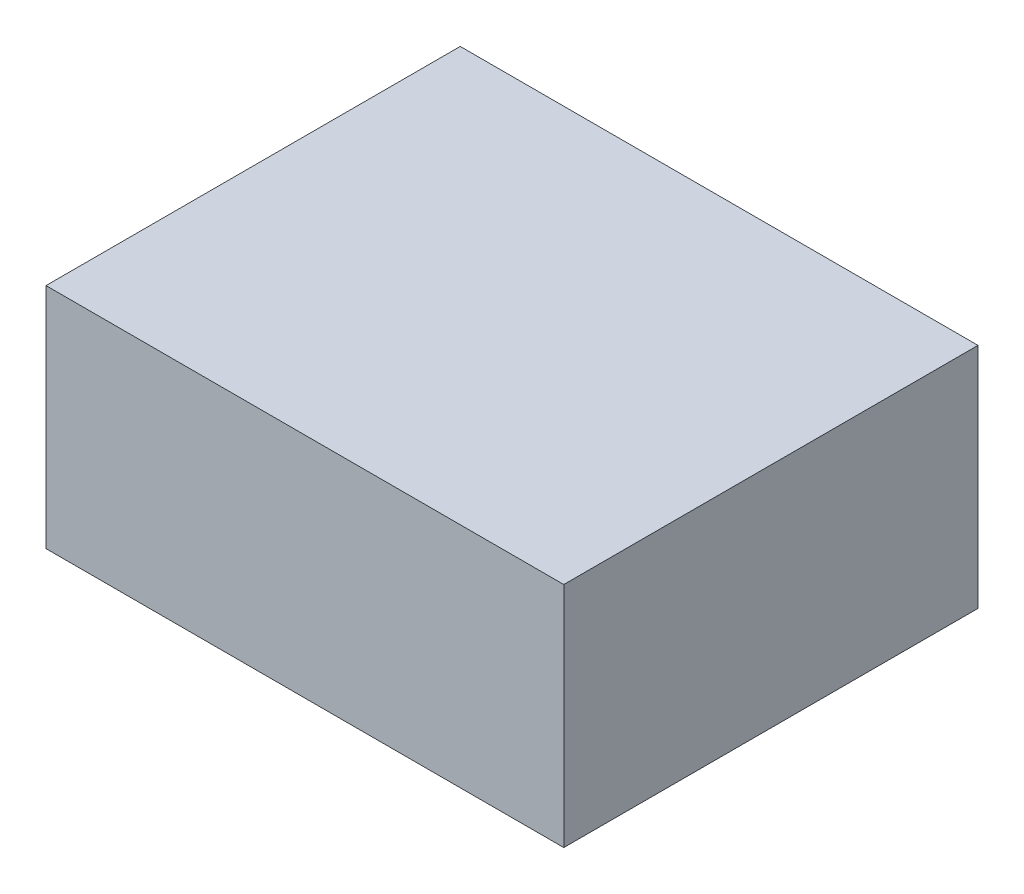
ISO-10303-21;
HEADER;
FILE_DESCRIPTION(('STEP AP214'),'2;1');
FILE_NAME('part.step','',(''),(''),'','','');
FILE_SCHEMA(('AUTOMOTIVE_DESIGN { 1 0 10303 214 1 1 1 1 }'));
ENDSEC;
DATA;
#1=APPLICATION_CONTEXT('core data for automotive mechanical design processes');
#2=APPLICATION_PROTOCOL_DEFINITION('international standard','automotive_design',2000,#1);
#3=PRODUCT_CONTEXT('',#1,'mechanical');
#4=PRODUCT('Part','Part','',(#3));
#5=PRODUCT_RELATED_PRODUCT_CATEGORY('part','',(#4));
#6=PRODUCT_DEFINITION_FORMATION('','',#4);
#7=PRODUCT_DEFINITION_CONTEXT('part definition',#1,'design');
#8=PRODUCT_DEFINITION('design','',#6,#7);
#9=PRODUCT_DEFINITION_SHAPE('','',#8);
#10=(LENGTH_UNIT() NAMED_UNIT(*) SI_UNIT(.MILLI.,.METRE.));
#11=(NAMED_UNIT(*) PLANE_ANGLE_UNIT() SI_UNIT($,.RADIAN.));
#12=(NAMED_UNIT(*) SI_UNIT($,.STERADIAN.) SOLID_ANGLE_UNIT());
#13=UNCERTAINTY_MEASURE_WITH_UNIT(LENGTH_MEASURE(1.E-05),#10,'distance_accuracy_value','');
#14=(GEOMETRIC_REPRESENTATION_CONTEXT(3) GLOBAL_UNCERTAINTY_ASSIGNED_CONTEXT((#13)) GLOBAL_UNIT_ASSIGNED_CONTEXT((#10,
#11,#12)) REPRESENTATION_CONTEXT('',''));
#15=CARTESIAN_POINT('',(0.,0.,0.));
#16=DIRECTION('',(0.,0.,1.));
#17=DIRECTION('',(1.,0.,0.));
#18=AXIS2_PLACEMENT_3D('',#15,#16,#17);
#19=CARTESIAN_POINT('',(-2.5,2.2,-2.));
#20=DIRECTION('',(1.,0.,0.));
#21=DIRECTION('',(0.,0.,-1.));
#22=AXIS2_PLACEMENT_3D('',#19,#20,#21);
#23=PLANE('',#22);
#24=DIRECTION('',(0.,0.,1.));
#25=VECTOR('',#24,1.);
#26=CARTESIAN_POINT('',(-2.5,0.,-2.));
#27=LINE('',#26,#25);
#28=CARTESIAN_POINT('',(-2.5,0.,-2.));
#29=VERTEX_POINT('',#28);
#30=CARTESIAN_POINT('',(-2.5,0.,2.));
#31=VERTEX_POINT('',#30);
#32=EDGE_CURVE('E97',#29,#31,#27,.T.);
#33=ORIENTED_EDGE('',*,*,#32,.T.);
#34=DIRECTION('',(0.,-1.,0.));
#35=VECTOR('',#34,1.);
#36=CARTESIAN_POINT('',(-2.5,2.2,2.));
#37=LINE('',#36,#35);
#38=CARTESIAN_POINT('',(-2.5,2.2,2.));
#39=VERTEX_POINT('',#38);
#40=EDGE_CURVE('E11',#39,#31,#37,.T.);
#41=ORIENTED_EDGE('',*,*,#40,.F.);
#42=DIRECTION('',(0.,0.,1.));
#43=VECTOR('',#42,1.);
#44=CARTESIAN_POINT('',(-2.5,2.2,-2.));
#45=LINE('',#44,#43);
#46=CARTESIAN_POINT('',(-2.5,2.2,-2.));
#47=VERTEX_POINT('',#46);
#48=EDGE_CURVE('E85',#47,#39,#45,.T.);
#49=ORIENTED_EDGE('',*,*,#48,.F.);
#50=DIRECTION('',(0.,-1.,0.));
#51=VECTOR('',#50,1.);
#52=CARTESIAN_POINT('',(-2.5,2.2,-2.));
#53=LINE('',#52,#51);
#54=EDGE_CURVE('E93',#47,#29,#53,.T.);
#55=ORIENTED_EDGE('',*,*,#54,.T.);
#56=EDGE_LOOP('',(#33,#41,#49,#55));
#57=FACE_BOUND('',#56,.T.);
#58=ADVANCED_FACE('F34',(#57),#23,.F.);
#59=CARTESIAN_POINT('',(-2.5,2.2,2.));
#60=DIRECTION('',(0.,0.,-1.));
#61=DIRECTION('',(-1.,0.,0.));
#62=AXIS2_PLACEMENT_3D('',#59,#60,#61);
#63=PLANE('',#62);
#64=DIRECTION('',(1.,0.,0.));
#65=VECTOR('',#64,1.);
#66=CARTESIAN_POINT('',(-2.5,0.,2.));
#67=LINE('',#66,#65);
#68=CARTESIAN_POINT('',(2.5,0.,2.));
#69=VERTEX_POINT('',#68);
#70=EDGE_CURVE('E89',#31,#69,#67,.T.);
#71=ORIENTED_EDGE('',*,*,#70,.T.);
#72=DIRECTION('',(0.,-1.,0.));
#73=VECTOR('',#72,1.);
#74=CARTESIAN_POINT('',(2.5,2.2,2.));
#75=LINE('',#74,#73);
#76=CARTESIAN_POINT('',(2.5,2.2,2.));
#77=VERTEX_POINT('',#76);
#78=EDGE_CURVE('E42',#77,#69,#75,.T.);
#79=ORIENTED_EDGE('',*,*,#78,.F.);
#80=DIRECTION('',(1.,0.,0.));
#81=VECTOR('',#80,1.);
#82=CARTESIAN_POINT('',(-2.5,2.2,2.));
#83=LINE('',#82,#81);
#84=EDGE_CURVE('E80',#39,#77,#83,.T.);
#85=ORIENTED_EDGE('',*,*,#84,.F.);
#86=ORIENTED_EDGE('',*,*,#40,.T.);
#87=EDGE_LOOP('',(#71,#79,#85,#86));
#88=FACE_BOUND('',#87,.T.);
#89=ADVANCED_FACE('F88',(#88),#63,.F.);
#90=CARTESIAN_POINT('',(2.5,2.2,-2.));
#91=DIRECTION('',(-1.,0.,0.));
#92=DIRECTION('',(0.,0.,1.));
#93=AXIS2_PLACEMENT_3D('',#90,#91,#92);
#94=PLANE('',#93);
#95=DIRECTION('',(0.,0.,-1.));
#96=VECTOR('',#95,1.);
#97=CARTESIAN_POINT('',(2.5,0.,-2.));
#98=LINE('',#97,#96);
#99=CARTESIAN_POINT('',(2.5,0.,-2.));
#100=VERTEX_POINT('',#99);
#101=EDGE_CURVE('E67',#69,#100,#98,.T.);
#102=ORIENTED_EDGE('',*,*,#101,.T.);
#103=DIRECTION('',(0.,-1.,0.));
#104=VECTOR('',#103,1.);
#105=CARTESIAN_POINT('',(2.5,2.2,-2.));
#106=LINE('',#105,#104);
#107=CARTESIAN_POINT('',(2.5,2.2,-2.));
#108=VERTEX_POINT('',#107);
#109=EDGE_CURVE('E90',#108,#100,#106,.T.);
#110=ORIENTED_EDGE('',*,*,#109,.F.);
#111=DIRECTION('',(0.,0.,-1.));
#112=VECTOR('',#111,1.);
#113=CARTESIAN_POINT('',(2.5,2.2,-2.));
#114=LINE('',#113,#112);
#115=EDGE_CURVE('E83',#77,#108,#114,.T.);
#116=ORIENTED_EDGE('',*,*,#115,.F.);
#117=ORIENTED_EDGE('',*,*,#78,.T.);
#118=EDGE_LOOP('',(#102,#110,#116,#117));
#119=FACE_BOUND('',#118,.T.);
#120=ADVANCED_FACE('F91',(#119),#94,.F.);
#121=CARTESIAN_POINT('',(-2.5,2.2,-2.));
#122=DIRECTION('',(0.,0.,1.));
#123=DIRECTION('',(1.,0.,0.));
#124=AXIS2_PLACEMENT_3D('',#121,#122,#123);
#125=PLANE('',#124);
#126=DIRECTION('',(-1.,0.,0.));
#127=VECTOR('',#126,1.);
#128=CARTESIAN_POINT('',(-2.5,0.,-2.));
#129=LINE('',#128,#127);
#130=EDGE_CURVE('E73',#100,#29,#129,.T.);
#131=ORIENTED_EDGE('',*,*,#130,.T.);
#132=ORIENTED_EDGE('',*,*,#54,.F.);
#133=DIRECTION('',(-1.,0.,0.));
#134=VECTOR('',#133,1.);
#135=CARTESIAN_POINT('',(-2.5,2.2,-2.));
#136=LINE('',#135,#134);
#137=EDGE_CURVE('E50',#108,#47,#136,.T.);
#138=ORIENTED_EDGE('',*,*,#137,.F.);
#139=ORIENTED_EDGE('',*,*,#109,.T.);
#140=EDGE_LOOP('',(#131,#132,#138,#139));
#141=FACE_BOUND('',#140,.T.);
#142=ADVANCED_FACE('F104',(#141),#125,.F.);
#143=CARTESIAN_POINT('',(0.,2.2,0.));
#144=DIRECTION('',(0.,1.,0.));
#145=DIRECTION('',(0.,0.,1.));
#146=AXIS2_PLACEMENT_3D('',#143,#144,#145);
#147=PLANE('',#146);
#148=ORIENTED_EDGE('',*,*,#48,.T.);
#149=ORIENTED_EDGE('',*,*,#84,.T.);
#150=ORIENTED_EDGE('',*,*,#115,.T.);
#151=ORIENTED_EDGE('',*,*,#137,.T.);
#152=EDGE_LOOP('',(#148,#149,#150,#151));
#153=FACE_BOUND('',#152,.T.);
#154=ADVANCED_FACE('F81',(#153),#147,.T.);
#155=CARTESIAN_POINT('',(0.,0.,0.));
#156=DIRECTION('',(0.,1.,0.));
#157=DIRECTION('',(0.,0.,1.));
#158=AXIS2_PLACEMENT_3D('',#155,#156,#157);
#159=PLANE('',#158);
#160=ORIENTED_EDGE('',*,*,#32,.F.);
#161=ORIENTED_EDGE('',*,*,#130,.F.);
#162=ORIENTED_EDGE('',*,*,#101,.F.);
#163=ORIENTED_EDGE('',*,*,#70,.F.);
#164=EDGE_LOOP('',(#160,#161,#162,#163));
#165=FACE_BOUND('',#164,.T.);
#166=ADVANCED_FACE('F107',(#165),#159,.F.);
#167=CLOSED_SHELL('',(#58,#89,#120,#142,#154,#166));
#168=MANIFOLD_SOLID_BREP('B2',#167);
#169=ADVANCED_BREP_SHAPE_REPRESENTATION('',(#18,#168),#14);
#170=SHAPE_DEFINITION_REPRESENTATION(#9,#169);
ENDSEC;
END-ISO-10303-21;
